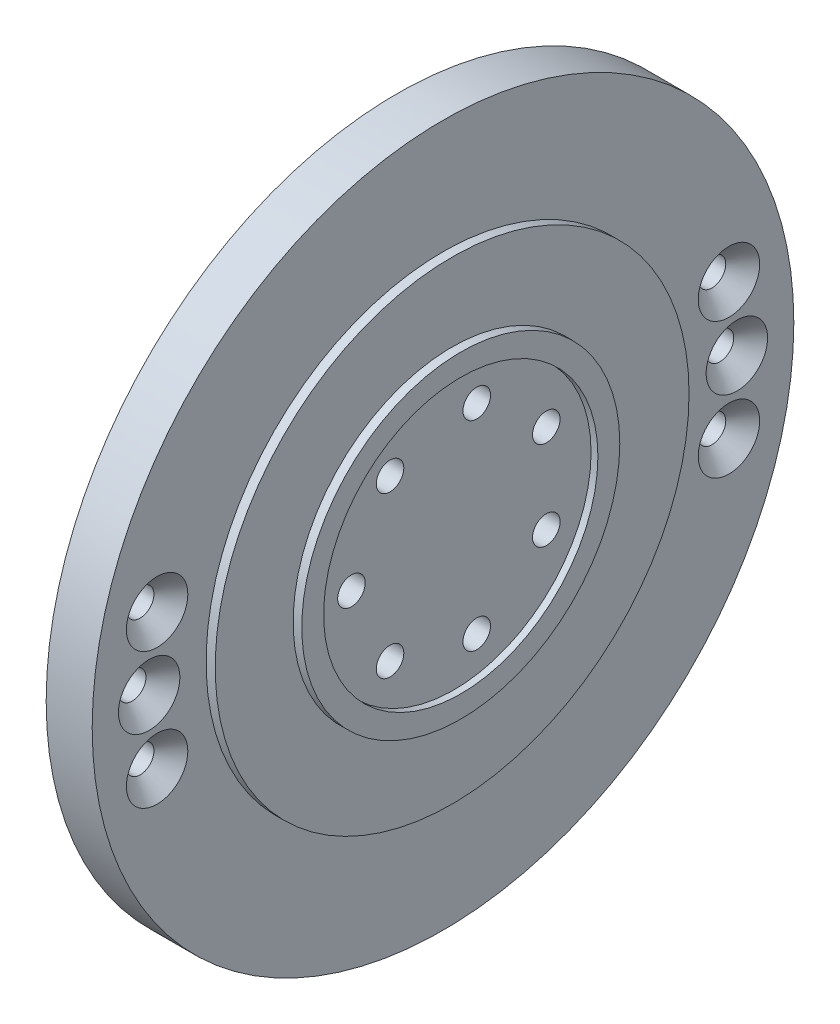
ISO-10303-21;
HEADER;
FILE_DESCRIPTION(('STEP AP214'),'2;1');
FILE_NAME('part.step','',(''),(''),'','','');
FILE_SCHEMA(('AUTOMOTIVE_DESIGN { 1 0 10303 214 1 1 1 1 }'));
ENDSEC;
DATA;
#1=APPLICATION_CONTEXT('core data for automotive mechanical design processes');
#2=APPLICATION_PROTOCOL_DEFINITION('international standard','automotive_design',2000,#1);
#3=PRODUCT_CONTEXT('',#1,'mechanical');
#4=PRODUCT('Part','Part','',(#3));
#5=PRODUCT_RELATED_PRODUCT_CATEGORY('part','',(#4));
#6=PRODUCT_DEFINITION_FORMATION('','',#4);
#7=PRODUCT_DEFINITION_CONTEXT('part definition',#1,'design');
#8=PRODUCT_DEFINITION('design','',#6,#7);
#9=PRODUCT_DEFINITION_SHAPE('','',#8);
#10=(LENGTH_UNIT() NAMED_UNIT(*) SI_UNIT(.MILLI.,.METRE.));
#11=(NAMED_UNIT(*) PLANE_ANGLE_UNIT() SI_UNIT($,.RADIAN.));
#12=(NAMED_UNIT(*) SI_UNIT($,.STERADIAN.) SOLID_ANGLE_UNIT());
#13=UNCERTAINTY_MEASURE_WITH_UNIT(LENGTH_MEASURE(1.E-05),#10,'distance_accuracy_value','');
#14=(GEOMETRIC_REPRESENTATION_CONTEXT(3) GLOBAL_UNCERTAINTY_ASSIGNED_CONTEXT((#13)) GLOBAL_UNIT_ASSIGNED_CONTEXT((#10,
#11,#12)) REPRESENTATION_CONTEXT('',''));
#15=CARTESIAN_POINT('',(0.,0.,0.));
#16=DIRECTION('',(0.,0.,1.));
#17=DIRECTION('',(1.,0.,0.));
#18=AXIS2_PLACEMENT_3D('',#15,#16,#17);
#19=CARTESIAN_POINT('',(-3.81,7.44912436188231,31.3779069767442));
#20=DIRECTION('',(1.,0.,0.));
#21=DIRECTION('',(0.,0.,-1.));
#22=AXIS2_PLACEMENT_3D('',#19,#20,#21);
#23=CONICAL_SURFACE('',#22,1.5125,0.785398163397448);
#24=CARTESIAN_POINT('',(-3.81,7.44912436188231,31.3779069767442));
#25=DIRECTION('',(1.,0.,0.));
#26=DIRECTION('',(0.,0.,-1.));
#27=AXIS2_PLACEMENT_3D('',#24,#25,#26);
#28=CIRCLE('',#27,1.5125);
#29=CARTESIAN_POINT('',(-3.81,7.44912436188231,29.8654069767442));
#30=VERTEX_POINT('',#29);
#31=EDGE_CURVE('E343',#30,#30,#28,.T.);
#32=ORIENTED_EDGE('',*,*,#31,.F.);
#33=EDGE_LOOP('',(#32));
#34=FACE_BOUND('',#33,.T.);
#35=CARTESIAN_POINT('',(-1.95,7.44912436188231,31.3779069767442));
#36=DIRECTION('',(-1.,0.,0.));
#37=DIRECTION('',(0.,0.,-1.));
#38=AXIS2_PLACEMENT_3D('',#35,#36,#37);
#39=CIRCLE('',#38,3.3725);
#40=CARTESIAN_POINT('',(-1.95,7.44912436188231,28.0054069767442));
#41=VERTEX_POINT('',#40);
#42=EDGE_CURVE('E276',#41,#41,#39,.T.);
#43=ORIENTED_EDGE('',*,*,#42,.F.);
#44=EDGE_LOOP('',(#43));
#45=FACE_BOUND('',#44,.T.);
#46=ADVANCED_FACE('F16',(#34,#45),#23,.F.);
#47=CARTESIAN_POINT('',(-3.81,0.,32.25));
#48=DIRECTION('',(1.,0.,0.));
#49=DIRECTION('',(0.,0.,-1.));
#50=AXIS2_PLACEMENT_3D('',#47,#48,#49);
#51=CONICAL_SURFACE('',#50,1.5125,0.785398163397448);
#52=CARTESIAN_POINT('',(-3.81,0.,32.25));
#53=DIRECTION('',(1.,0.,0.));
#54=DIRECTION('',(0.,0.,-1.));
#55=AXIS2_PLACEMENT_3D('',#52,#53,#54);
#56=CIRCLE('',#55,1.5125);
#57=CARTESIAN_POINT('',(-3.81,0.,30.7375));
#58=VERTEX_POINT('',#57);
#59=EDGE_CURVE('E256',#58,#58,#56,.T.);
#60=ORIENTED_EDGE('',*,*,#59,.F.);
#61=EDGE_LOOP('',(#60));
#62=FACE_BOUND('',#61,.T.);
#63=CARTESIAN_POINT('',(-1.95,0.,32.25));
#64=DIRECTION('',(-1.,0.,0.));
#65=DIRECTION('',(0.,0.,-1.));
#66=AXIS2_PLACEMENT_3D('',#63,#64,#65);
#67=CIRCLE('',#66,3.3725);
#68=CARTESIAN_POINT('',(-1.95,0.,28.8775));
#69=VERTEX_POINT('',#68);
#70=EDGE_CURVE('E272',#69,#69,#67,.T.);
#71=ORIENTED_EDGE('',*,*,#70,.F.);
#72=EDGE_LOOP('',(#71));
#73=FACE_BOUND('',#72,.T.);
#74=ADVANCED_FACE('F402',(#62,#73),#51,.F.);
#75=CARTESIAN_POINT('',(-3.81,7.44912436188231,-31.3779069767442));
#76=DIRECTION('',(1.,0.,0.));
#77=DIRECTION('',(0.,0.,-1.));
#78=AXIS2_PLACEMENT_3D('',#75,#76,#77);
#79=CONICAL_SURFACE('',#78,1.5125,0.785398163397448);
#80=CARTESIAN_POINT('',(-3.81,7.44912436188231,-31.3779069767442));
#81=DIRECTION('',(1.,0.,0.));
#82=DIRECTION('',(0.,0.,-1.));
#83=AXIS2_PLACEMENT_3D('',#80,#81,#82);
#84=CIRCLE('',#83,1.5125);
#85=CARTESIAN_POINT('',(-3.81,7.44912436188231,-32.8904069767442));
#86=VERTEX_POINT('',#85);
#87=EDGE_CURVE('E335',#86,#86,#84,.T.);
#88=ORIENTED_EDGE('',*,*,#87,.F.);
#89=EDGE_LOOP('',(#88));
#90=FACE_BOUND('',#89,.T.);
#91=CARTESIAN_POINT('',(-1.95,7.44912436188231,-31.3779069767442));
#92=DIRECTION('',(-1.,0.,0.));
#93=DIRECTION('',(0.,0.,-1.));
#94=AXIS2_PLACEMENT_3D('',#91,#92,#93);
#95=CIRCLE('',#94,3.3725);
#96=CARTESIAN_POINT('',(-1.95,7.44912436188231,-34.7504069767442));
#97=VERTEX_POINT('',#96);
#98=EDGE_CURVE('E275',#97,#97,#95,.T.);
#99=ORIENTED_EDGE('',*,*,#98,.F.);
#100=EDGE_LOOP('',(#99));
#101=FACE_BOUND('',#100,.T.);
#102=ADVANCED_FACE('F407',(#90,#101),#79,.F.);
#103=CARTESIAN_POINT('',(-3.81,-7.44912436188231,-31.3779069767442));
#104=DIRECTION('',(1.,0.,0.));
#105=DIRECTION('',(0.,0.,-1.));
#106=AXIS2_PLACEMENT_3D('',#103,#104,#105);
#107=CONICAL_SURFACE('',#106,1.5125,0.785398163397448);
#108=CARTESIAN_POINT('',(-3.81,-7.44912436188231,-31.3779069767442));
#109=DIRECTION('',(1.,0.,0.));
#110=DIRECTION('',(0.,0.,-1.));
#111=AXIS2_PLACEMENT_3D('',#108,#109,#110);
#112=CIRCLE('',#111,1.5125);
#113=CARTESIAN_POINT('',(-3.81,-7.44912436188231,-32.8904069767442));
#114=VERTEX_POINT('',#113);
#115=EDGE_CURVE('E135',#114,#114,#112,.T.);
#116=ORIENTED_EDGE('',*,*,#115,.F.);
#117=EDGE_LOOP('',(#116));
#118=FACE_BOUND('',#117,.T.);
#119=CARTESIAN_POINT('',(-1.95,-7.44912436188231,-31.3779069767442));
#120=DIRECTION('',(-1.,0.,0.));
#121=DIRECTION('',(0.,0.,-1.));
#122=AXIS2_PLACEMENT_3D('',#119,#120,#121);
#123=CIRCLE('',#122,3.3725);
#124=CARTESIAN_POINT('',(-1.95,-7.44912436188231,-34.7504069767442));
#125=VERTEX_POINT('',#124);
#126=EDGE_CURVE('E247',#125,#125,#123,.T.);
#127=ORIENTED_EDGE('',*,*,#126,.F.);
#128=EDGE_LOOP('',(#127));
#129=FACE_BOUND('',#128,.T.);
#130=ADVANCED_FACE('F429',(#118,#129),#107,.F.);
#131=CARTESIAN_POINT('',(-3.81,0.,-32.25));
#132=DIRECTION('',(1.,0.,0.));
#133=DIRECTION('',(0.,0.,-1.));
#134=AXIS2_PLACEMENT_3D('',#131,#132,#133);
#135=CONICAL_SURFACE('',#134,1.5125,0.785398163397448);
#136=CARTESIAN_POINT('',(-3.81,0.,-32.25));
#137=DIRECTION('',(1.,0.,0.));
#138=DIRECTION('',(0.,0.,-1.));
#139=AXIS2_PLACEMENT_3D('',#136,#137,#138);
#140=CIRCLE('',#139,1.5125);
#141=CARTESIAN_POINT('',(-3.81,0.,-33.7625));
#142=VERTEX_POINT('',#141);
#143=EDGE_CURVE('E294',#142,#142,#140,.T.);
#144=ORIENTED_EDGE('',*,*,#143,.F.);
#145=EDGE_LOOP('',(#144));
#146=FACE_BOUND('',#145,.T.);
#147=CARTESIAN_POINT('',(-1.95,0.,-32.25));
#148=DIRECTION('',(-1.,0.,0.));
#149=DIRECTION('',(0.,0.,-1.));
#150=AXIS2_PLACEMENT_3D('',#147,#148,#149);
#151=CIRCLE('',#150,3.3725);
#152=CARTESIAN_POINT('',(-1.95,0.,-35.6225));
#153=VERTEX_POINT('',#152);
#154=EDGE_CURVE('E27',#153,#153,#151,.T.);
#155=ORIENTED_EDGE('',*,*,#154,.F.);
#156=EDGE_LOOP('',(#155));
#157=FACE_BOUND('',#156,.T.);
#158=ADVANCED_FACE('F432',(#146,#157),#135,.F.);
#159=CARTESIAN_POINT('',(-3.81,-7.44912436188231,31.3779069767442));
#160=DIRECTION('',(1.,0.,0.));
#161=DIRECTION('',(0.,0.,-1.));
#162=AXIS2_PLACEMENT_3D('',#159,#160,#161);
#163=CONICAL_SURFACE('',#162,1.5125,0.785398163397448);
#164=CARTESIAN_POINT('',(-3.81,-7.44912436188231,31.3779069767442));
#165=DIRECTION('',(1.,0.,0.));
#166=DIRECTION('',(0.,0.,-1.));
#167=AXIS2_PLACEMENT_3D('',#164,#165,#166);
#168=CIRCLE('',#167,1.5125);
#169=CARTESIAN_POINT('',(-3.81,-7.44912436188231,29.8654069767442));
#170=VERTEX_POINT('',#169);
#171=EDGE_CURVE('E325',#170,#170,#168,.T.);
#172=ORIENTED_EDGE('',*,*,#171,.F.);
#173=EDGE_LOOP('',(#172));
#174=FACE_BOUND('',#173,.T.);
#175=CARTESIAN_POINT('',(-1.95,-7.44912436188231,31.3779069767442));
#176=DIRECTION('',(-1.,0.,0.));
#177=DIRECTION('',(0.,0.,-1.));
#178=AXIS2_PLACEMENT_3D('',#175,#176,#177);
#179=CIRCLE('',#178,3.3725);
#180=CARTESIAN_POINT('',(-1.95,-7.44912436188231,28.0054069767442));
#181=VERTEX_POINT('',#180);
#182=EDGE_CURVE('E11',#181,#181,#179,.T.);
#183=ORIENTED_EDGE('',*,*,#182,.F.);
#184=EDGE_LOOP('',(#183));
#185=FACE_BOUND('',#184,.T.);
#186=ADVANCED_FACE('F423',(#174,#185),#163,.F.);
#187=CARTESIAN_POINT('',(-5.14,0.,11.25));
#188=DIRECTION('',(-1.,0.,0.));
#189=DIRECTION('',(0.,0.,1.));
#190=AXIS2_PLACEMENT_3D('',#187,#188,#189);
#191=CONICAL_SURFACE('',#190,1.5125,0.785398163397448);
#192=CARTESIAN_POINT('',(-7.,0.,11.25));
#193=DIRECTION('',(-1.,0.,0.));
#194=DIRECTION('',(0.,0.,-1.));
#195=AXIS2_PLACEMENT_3D('',#192,#193,#194);
#196=CIRCLE('',#195,3.3725);
#197=CARTESIAN_POINT('',(-7.,0.,7.8775));
#198=VERTEX_POINT('',#197);
#199=EDGE_CURVE('E361',#198,#198,#196,.T.);
#200=ORIENTED_EDGE('',*,*,#199,.T.);
#201=EDGE_LOOP('',(#200));
#202=FACE_BOUND('',#201,.T.);
#203=CARTESIAN_POINT('',(-5.14,0.,11.25));
#204=DIRECTION('',(-1.,0.,0.));
#205=DIRECTION('',(0.,0.,1.));
#206=AXIS2_PLACEMENT_3D('',#203,#204,#205);
#207=CIRCLE('',#206,1.5125);
#208=CARTESIAN_POINT('',(-5.14,0.,12.7625));
#209=VERTEX_POINT('',#208);
#210=EDGE_CURVE('E270',#209,#209,#207,.T.);
#211=ORIENTED_EDGE('',*,*,#210,.F.);
#212=EDGE_LOOP('',(#211));
#213=FACE_BOUND('',#212,.T.);
#214=ADVANCED_FACE('F419',(#202,#213),#191,.F.);
#215=CARTESIAN_POINT('',(-5.14,8.79560417776534,7.01426027091075));
#216=DIRECTION('',(-1.,0.,0.));
#217=DIRECTION('',(0.,0.,1.));
#218=AXIS2_PLACEMENT_3D('',#215,#216,#217);
#219=CONICAL_SURFACE('',#218,1.5125,0.785398163397448);
#220=CARTESIAN_POINT('',(-7.,8.79560417776534,7.01426027091075));
#221=DIRECTION('',(-1.,0.,0.));
#222=DIRECTION('',(0.,0.,-1.));
#223=AXIS2_PLACEMENT_3D('',#220,#221,#222);
#224=CIRCLE('',#223,3.3725);
#225=CARTESIAN_POINT('',(-7.,8.79560417776534,3.64176027091075));
#226=VERTEX_POINT('',#225);
#227=EDGE_CURVE('E266',#226,#226,#224,.T.);
#228=ORIENTED_EDGE('',*,*,#227,.T.);
#229=EDGE_LOOP('',(#228));
#230=FACE_BOUND('',#229,.T.);
#231=CARTESIAN_POINT('',(-5.14,8.79560417776534,7.01426027091075));
#232=DIRECTION('',(-1.,0.,0.));
#233=DIRECTION('',(0.,0.,1.));
#234=AXIS2_PLACEMENT_3D('',#231,#232,#233);
#235=CIRCLE('',#234,1.5125);
#236=CARTESIAN_POINT('',(-5.14,8.79560417776534,8.52676027091075));
#237=VERTEX_POINT('',#236);
#238=EDGE_CURVE('E286',#237,#237,#235,.T.);
#239=ORIENTED_EDGE('',*,*,#238,.F.);
#240=EDGE_LOOP('',(#239));
#241=FACE_BOUND('',#240,.T.);
#242=ADVANCED_FACE('F422',(#230,#241),#219,.F.);
#243=CARTESIAN_POINT('',(-5.14,-8.79560417776534,7.01426027091075));
#244=DIRECTION('',(-1.,0.,0.));
#245=DIRECTION('',(0.,0.,1.));
#246=AXIS2_PLACEMENT_3D('',#243,#244,#245);
#247=CONICAL_SURFACE('',#246,1.5125,0.785398163397448);
#248=CARTESIAN_POINT('',(-7.,-8.79560417776534,7.01426027091075));
#249=DIRECTION('',(-1.,0.,0.));
#250=DIRECTION('',(0.,0.,-1.));
#251=AXIS2_PLACEMENT_3D('',#248,#249,#250);
#252=CIRCLE('',#251,3.3725);
#253=CARTESIAN_POINT('',(-7.,-8.79560417776534,3.64176027091075));
#254=VERTEX_POINT('',#253);
#255=EDGE_CURVE('E262',#254,#254,#252,.T.);
#256=ORIENTED_EDGE('',*,*,#255,.T.);
#257=EDGE_LOOP('',(#256));
#258=FACE_BOUND('',#257,.T.);
#259=CARTESIAN_POINT('',(-5.14,-8.79560417776534,7.01426027091075));
#260=DIRECTION('',(-1.,0.,0.));
#261=DIRECTION('',(0.,0.,1.));
#262=AXIS2_PLACEMENT_3D('',#259,#260,#261);
#263=CIRCLE('',#262,1.5125);
#264=CARTESIAN_POINT('',(-5.14,-8.79560417776534,8.52676027091075));
#265=VERTEX_POINT('',#264);
#266=EDGE_CURVE('E271',#265,#265,#263,.T.);
#267=ORIENTED_EDGE('',*,*,#266,.F.);
#268=EDGE_LOOP('',(#267));
#269=FACE_BOUND('',#268,.T.);
#270=ADVANCED_FACE('F427',(#258,#269),#247,.F.);
#271=CARTESIAN_POINT('',(-5.14,-10.9679390120455,-2.50336050700853));
#272=DIRECTION('',(-1.,0.,0.));
#273=DIRECTION('',(0.,0.,1.));
#274=AXIS2_PLACEMENT_3D('',#271,#272,#273);
#275=CONICAL_SURFACE('',#274,1.5125,0.785398163397448);
#276=CARTESIAN_POINT('',(-7.,-10.9679390120455,-2.50336050700853));
#277=DIRECTION('',(-1.,0.,0.));
#278=DIRECTION('',(0.,0.,-1.));
#279=AXIS2_PLACEMENT_3D('',#276,#277,#278);
#280=CIRCLE('',#279,3.3725);
#281=CARTESIAN_POINT('',(-7.,-10.9679390120455,-5.87586050700853));
#282=VERTEX_POINT('',#281);
#283=EDGE_CURVE('E252',#282,#282,#280,.T.);
#284=ORIENTED_EDGE('',*,*,#283,.T.);
#285=EDGE_LOOP('',(#284));
#286=FACE_BOUND('',#285,.T.);
#287=CARTESIAN_POINT('',(-5.14,-10.9679390120455,-2.50336050700853));
#288=DIRECTION('',(-1.,0.,0.));
#289=DIRECTION('',(0.,0.,1.));
#290=AXIS2_PLACEMENT_3D('',#287,#288,#289);
#291=CIRCLE('',#290,1.5125);
#292=CARTESIAN_POINT('',(-5.14,-10.9679390120455,-0.990860507008535));
#293=VERTEX_POINT('',#292);
#294=EDGE_CURVE('E304',#293,#293,#291,.T.);
#295=ORIENTED_EDGE('',*,*,#294,.F.);
#296=EDGE_LOOP('',(#295));
#297=FACE_BOUND('',#296,.T.);
#298=ADVANCED_FACE('F484',(#286,#297),#275,.F.);
#299=CARTESIAN_POINT('',(-5.14,4.88119206507253,-10.1358997639022));
#300=DIRECTION('',(-1.,0.,0.));
#301=DIRECTION('',(0.,0.,1.));
#302=AXIS2_PLACEMENT_3D('',#299,#300,#301);
#303=CONICAL_SURFACE('',#302,1.5125,0.785398163397448);
#304=CARTESIAN_POINT('',(-7.,4.88119206507253,-10.1358997639022));
#305=DIRECTION('',(-1.,0.,0.));
#306=DIRECTION('',(0.,0.,-1.));
#307=AXIS2_PLACEMENT_3D('',#304,#305,#306);
#308=CIRCLE('',#307,3.3725);
#309=CARTESIAN_POINT('',(-7.,4.88119206507253,-13.5083997639022));
#310=VERTEX_POINT('',#309);
#311=EDGE_CURVE('E248',#310,#310,#308,.T.);
#312=ORIENTED_EDGE('',*,*,#311,.T.);
#313=EDGE_LOOP('',(#312));
#314=FACE_BOUND('',#313,.T.);
#315=CARTESIAN_POINT('',(-5.14,4.88119206507253,-10.1358997639022));
#316=DIRECTION('',(-1.,0.,0.));
#317=DIRECTION('',(0.,0.,1.));
#318=AXIS2_PLACEMENT_3D('',#315,#316,#317);
#319=CIRCLE('',#318,1.5125);
#320=CARTESIAN_POINT('',(-5.14,4.88119206507253,-8.6233997639022));
#321=VERTEX_POINT('',#320);
#322=EDGE_CURVE('E228',#321,#321,#319,.T.);
#323=ORIENTED_EDGE('',*,*,#322,.F.);
#324=EDGE_LOOP('',(#323));
#325=FACE_BOUND('',#324,.T.);
#326=ADVANCED_FACE('F482',(#314,#325),#303,.F.);
#327=CARTESIAN_POINT('',(-5.14,10.9679390120455,-2.50336050700854));
#328=DIRECTION('',(-1.,0.,0.));
#329=DIRECTION('',(0.,0.,1.));
#330=AXIS2_PLACEMENT_3D('',#327,#328,#329);
#331=CONICAL_SURFACE('',#330,1.5125,0.785398163397448);
#332=CARTESIAN_POINT('',(-7.,10.9679390120455,-2.50336050700854));
#333=DIRECTION('',(-1.,0.,0.));
#334=DIRECTION('',(0.,0.,-1.));
#335=AXIS2_PLACEMENT_3D('',#332,#333,#334);
#336=CIRCLE('',#335,3.3725);
#337=CARTESIAN_POINT('',(-7.,10.9679390120455,-5.87586050700854));
#338=VERTEX_POINT('',#337);
#339=EDGE_CURVE('E251',#338,#338,#336,.T.);
#340=ORIENTED_EDGE('',*,*,#339,.T.);
#341=EDGE_LOOP('',(#340));
#342=FACE_BOUND('',#341,.T.);
#343=CARTESIAN_POINT('',(-5.14,10.9679390120455,-2.50336050700854));
#344=DIRECTION('',(-1.,0.,0.));
#345=DIRECTION('',(0.,0.,1.));
#346=AXIS2_PLACEMENT_3D('',#343,#344,#345);
#347=CIRCLE('',#346,1.5125);
#348=CARTESIAN_POINT('',(-5.14,10.9679390120455,-0.99086050700854));
#349=VERTEX_POINT('',#348);
#350=EDGE_CURVE('E229',#349,#349,#347,.T.);
#351=ORIENTED_EDGE('',*,*,#350,.F.);
#352=EDGE_LOOP('',(#351));
#353=FACE_BOUND('',#352,.T.);
#354=ADVANCED_FACE('F478',(#342,#353),#331,.F.);
#355=CARTESIAN_POINT('',(-5.14,-4.88119206507253,-10.1358997639022));
#356=DIRECTION('',(-1.,0.,0.));
#357=DIRECTION('',(0.,0.,1.));
#358=AXIS2_PLACEMENT_3D('',#355,#356,#357);
#359=CONICAL_SURFACE('',#358,1.5125,0.785398163397448);
#360=CARTESIAN_POINT('',(-7.,-4.88119206507253,-10.1358997639022));
#361=DIRECTION('',(-1.,0.,0.));
#362=DIRECTION('',(0.,0.,-1.));
#363=AXIS2_PLACEMENT_3D('',#360,#361,#362);
#364=CIRCLE('',#363,3.3725);
#365=CARTESIAN_POINT('',(-7.,-4.88119206507253,-13.5083997639022));
#366=VERTEX_POINT('',#365);
#367=EDGE_CURVE('E279',#366,#366,#364,.T.);
#368=ORIENTED_EDGE('',*,*,#367,.T.);
#369=EDGE_LOOP('',(#368));
#370=FACE_BOUND('',#369,.T.);
#371=CARTESIAN_POINT('',(-5.14,-4.88119206507253,-10.1358997639022));
#372=DIRECTION('',(-1.,0.,0.));
#373=DIRECTION('',(0.,0.,1.));
#374=AXIS2_PLACEMENT_3D('',#371,#372,#373);
#375=CIRCLE('',#374,1.5125);
#376=CARTESIAN_POINT('',(-5.14,-4.88119206507253,-8.6233997639022));
#377=VERTEX_POINT('',#376);
#378=EDGE_CURVE('E296',#377,#377,#375,.T.);
#379=ORIENTED_EDGE('',*,*,#378,.F.);
#380=EDGE_LOOP('',(#379));
#381=FACE_BOUND('',#380,.T.);
#382=ADVANCED_FACE('F417',(#370,#381),#359,.F.);
#383=CARTESIAN_POINT('',(-1.95,0.,0.));
#384=DIRECTION('',(1.,0.,0.));
#385=DIRECTION('',(0.,1.,0.));
#386=AXIS2_PLACEMENT_3D('',#383,#384,#385);
#387=PLANE('',#386);
#388=CARTESIAN_POINT('',(-1.95,0.,0.));
#389=DIRECTION('',(1.,0.,0.));
#390=DIRECTION('',(0.,0.,-1.));
#391=AXIS2_PLACEMENT_3D('',#388,#389,#390);
#392=CIRCLE('',#391,38.5);
#393=CARTESIAN_POINT('',(-1.95,0.,-38.5));
#394=VERTEX_POINT('',#393);
#395=EDGE_CURVE('E257',#394,#394,#392,.T.);
#396=ORIENTED_EDGE('',*,*,#395,.T.);
#397=EDGE_LOOP('',(#396));
#398=FACE_BOUND('',#397,.T.);
#399=CARTESIAN_POINT('',(-1.95,0.,0.));
#400=DIRECTION('',(1.,0.,0.));
#401=DIRECTION('',(0.,0.,-1.));
#402=AXIS2_PLACEMENT_3D('',#399,#400,#401);
#403=CIRCLE('',#402,26.);
#404=CARTESIAN_POINT('',(-1.95,0.,-26.));
#405=VERTEX_POINT('',#404);
#406=EDGE_CURVE('E243',#405,#405,#403,.T.);
#407=ORIENTED_EDGE('',*,*,#406,.F.);
#408=EDGE_LOOP('',(#407));
#409=FACE_BOUND('',#408,.T.);
#410=ORIENTED_EDGE('',*,*,#182,.T.);
#411=EDGE_LOOP('',(#410));
#412=FACE_BOUND('',#411,.T.);
#413=ORIENTED_EDGE('',*,*,#154,.T.);
#414=EDGE_LOOP('',(#413));
#415=FACE_BOUND('',#414,.T.);
#416=ORIENTED_EDGE('',*,*,#126,.T.);
#417=EDGE_LOOP('',(#416));
#418=FACE_BOUND('',#417,.T.);
#419=ORIENTED_EDGE('',*,*,#98,.T.);
#420=EDGE_LOOP('',(#419));
#421=FACE_BOUND('',#420,.T.);
#422=ORIENTED_EDGE('',*,*,#70,.T.);
#423=EDGE_LOOP('',(#422));
#424=FACE_BOUND('',#423,.T.);
#425=ORIENTED_EDGE('',*,*,#42,.T.);
#426=EDGE_LOOP('',(#425));
#427=FACE_BOUND('',#426,.T.);
#428=ADVANCED_FACE('F413',(#398,#409,#412,#415,#418,#421,#424,#427),#387,.T.);
#429=CARTESIAN_POINT('',(-1.95,0.,0.));
#430=DIRECTION('',(1.,0.,0.));
#431=DIRECTION('',(0.,0.,-1.));
#432=AXIS2_PLACEMENT_3D('',#429,#430,#431);
#433=CYLINDRICAL_SURFACE('',#432,26.);
#434=CARTESIAN_POINT('',(-0.95,0.,0.));
#435=DIRECTION('',(1.,0.,0.));
#436=DIRECTION('',(0.,0.,-1.));
#437=AXIS2_PLACEMENT_3D('',#434,#435,#436);
#438=CIRCLE('',#437,26.);
#439=CARTESIAN_POINT('',(-0.95,0.,-26.));
#440=VERTEX_POINT('',#439);
#441=EDGE_CURVE('E282',#440,#440,#438,.T.);
#442=ORIENTED_EDGE('',*,*,#441,.F.);
#443=EDGE_LOOP('',(#442));
#444=FACE_BOUND('',#443,.T.);
#445=ORIENTED_EDGE('',*,*,#406,.T.);
#446=EDGE_LOOP('',(#445));
#447=FACE_BOUND('',#446,.T.);
#448=ADVANCED_FACE('F416',(#444,#447),#433,.T.);
#449=CARTESIAN_POINT('',(-0.75,0.,0.));
#450=DIRECTION('',(1.,0.,0.));
#451=DIRECTION('',(0.,1.,0.));
#452=AXIS2_PLACEMENT_3D('',#449,#450,#451);
#453=PLANE('',#452);
#454=CARTESIAN_POINT('',(-0.75,0.,0.));
#455=DIRECTION('',(1.,0.,0.));
#456=DIRECTION('',(0.,0.,-1.));
#457=AXIS2_PLACEMENT_3D('',#454,#455,#456);
#458=CIRCLE('',#457,15.05);
#459=CARTESIAN_POINT('',(-0.75,0.,-15.05));
#460=VERTEX_POINT('',#459);
#461=EDGE_CURVE('E320',#460,#460,#458,.T.);
#462=ORIENTED_EDGE('',*,*,#461,.T.);
#463=EDGE_LOOP('',(#462));
#464=FACE_BOUND('',#463,.T.);
#465=CARTESIAN_POINT('',(-0.75,8.79560417776534,7.01426027091075));
#466=DIRECTION('',(1.,0.,0.));
#467=DIRECTION('',(0.,0.,-1.));
#468=AXIS2_PLACEMENT_3D('',#465,#466,#467);
#469=CIRCLE('',#468,1.5125);
#470=CARTESIAN_POINT('',(-0.75,8.79560417776534,5.50176027091075));
#471=VERTEX_POINT('',#470);
#472=EDGE_CURVE('E289',#471,#471,#469,.T.);
#473=ORIENTED_EDGE('',*,*,#472,.F.);
#474=EDGE_LOOP('',(#473));
#475=FACE_BOUND('',#474,.T.);
#476=CARTESIAN_POINT('',(-0.75,10.9679390120455,-2.50336050700854));
#477=DIRECTION('',(1.,0.,0.));
#478=DIRECTION('',(0.,0.,-1.));
#479=AXIS2_PLACEMENT_3D('',#476,#477,#478);
#480=CIRCLE('',#479,1.5125);
#481=CARTESIAN_POINT('',(-0.75,10.9679390120455,-4.01586050700854));
#482=VERTEX_POINT('',#481);
#483=EDGE_CURVE('E239',#482,#482,#480,.T.);
#484=ORIENTED_EDGE('',*,*,#483,.F.);
#485=EDGE_LOOP('',(#484));
#486=FACE_BOUND('',#485,.T.);
#487=CARTESIAN_POINT('',(-0.75,4.88119206507253,-10.1358997639022));
#488=DIRECTION('',(1.,0.,0.));
#489=DIRECTION('',(0.,0.,-1.));
#490=AXIS2_PLACEMENT_3D('',#487,#488,#489);
#491=CIRCLE('',#490,1.5125);
#492=CARTESIAN_POINT('',(-0.75,4.88119206507253,-11.6483997639022));
#493=VERTEX_POINT('',#492);
#494=EDGE_CURVE('E224',#493,#493,#491,.T.);
#495=ORIENTED_EDGE('',*,*,#494,.F.);
#496=EDGE_LOOP('',(#495));
#497=FACE_BOUND('',#496,.T.);
#498=CARTESIAN_POINT('',(-0.75,-4.88119206507253,-10.1358997639022));
#499=DIRECTION('',(1.,0.,0.));
#500=DIRECTION('',(0.,0.,-1.));
#501=AXIS2_PLACEMENT_3D('',#498,#499,#500);
#502=CIRCLE('',#501,1.5125);
#503=CARTESIAN_POINT('',(-0.75,-4.88119206507253,-11.6483997639022));
#504=VERTEX_POINT('',#503);
#505=EDGE_CURVE('E236',#504,#504,#502,.T.);
#506=ORIENTED_EDGE('',*,*,#505,.F.);
#507=EDGE_LOOP('',(#506));
#508=FACE_BOUND('',#507,.T.);
#509=CARTESIAN_POINT('',(-0.75,-10.9679390120455,-2.50336050700853));
#510=DIRECTION('',(1.,0.,0.));
#511=DIRECTION('',(0.,0.,-1.));
#512=AXIS2_PLACEMENT_3D('',#509,#510,#511);
#513=CIRCLE('',#512,1.5125);
#514=CARTESIAN_POINT('',(-0.75,-10.9679390120455,-4.01586050700853));
#515=VERTEX_POINT('',#514);
#516=EDGE_CURVE('E312',#515,#515,#513,.T.);
#517=ORIENTED_EDGE('',*,*,#516,.F.);
#518=EDGE_LOOP('',(#517));
#519=FACE_BOUND('',#518,.T.);
#520=CARTESIAN_POINT('',(-0.75,-8.79560417776534,7.01426027091075));
#521=DIRECTION('',(1.,0.,0.));
#522=DIRECTION('',(0.,0.,-1.));
#523=AXIS2_PLACEMENT_3D('',#520,#521,#522);
#524=CIRCLE('',#523,1.5125);
#525=CARTESIAN_POINT('',(-0.75,-8.79560417776534,5.50176027091075));
#526=VERTEX_POINT('',#525);
#527=EDGE_CURVE('E299',#526,#526,#524,.T.);
#528=ORIENTED_EDGE('',*,*,#527,.F.);
#529=EDGE_LOOP('',(#528));
#530=FACE_BOUND('',#529,.T.);
#531=CARTESIAN_POINT('',(-0.75,0.,11.25));
#532=DIRECTION('',(1.,0.,0.));
#533=DIRECTION('',(0.,0.,-1.));
#534=AXIS2_PLACEMENT_3D('',#531,#532,#533);
#535=CIRCLE('',#534,1.5125);
#536=CARTESIAN_POINT('',(-0.75,0.,9.7375));
#537=VERTEX_POINT('',#536);
#538=EDGE_CURVE('E267',#537,#537,#535,.T.);
#539=ORIENTED_EDGE('',*,*,#538,.F.);
#540=EDGE_LOOP('',(#539));
#541=FACE_BOUND('',#540,.T.);
#542=ADVANCED_FACE('F471',(#464,#475,#486,#497,#508,#519,#530,#541),#453,.T.);
#543=CARTESIAN_POINT('',(-0.75,0.,0.));
#544=DIRECTION('',(1.,0.,0.));
#545=DIRECTION('',(0.,0.,-1.));
#546=AXIS2_PLACEMENT_3D('',#543,#544,#545);
#547=CYLINDRICAL_SURFACE('',#546,15.05);
#548=CARTESIAN_POINT('',(0.,0.,0.));
#549=DIRECTION('',(1.,0.,0.));
#550=DIRECTION('',(0.,0.,-1.));
#551=AXIS2_PLACEMENT_3D('',#548,#549,#550);
#552=CIRCLE('',#551,15.05);
#553=CARTESIAN_POINT('',(0.,0.,-15.05));
#554=VERTEX_POINT('',#553);
#555=EDGE_CURVE('E280',#554,#554,#552,.T.);
#556=ORIENTED_EDGE('',*,*,#555,.T.);
#557=EDGE_LOOP('',(#556));
#558=FACE_BOUND('',#557,.T.);
#559=ORIENTED_EDGE('',*,*,#461,.F.);
#560=EDGE_LOOP('',(#559));
#561=FACE_BOUND('',#560,.T.);
#562=ADVANCED_FACE('F474',(#558,#561),#547,.F.);
#563=CARTESIAN_POINT('',(-0.95,0.,0.));
#564=DIRECTION('',(1.,0.,0.));
#565=DIRECTION('',(0.,0.,-1.));
#566=AXIS2_PLACEMENT_3D('',#563,#564,#565);
#567=CYLINDRICAL_SURFACE('',#566,17.45);
#568=CARTESIAN_POINT('',(0.,0.,0.));
#569=DIRECTION('',(1.,0.,0.));
#570=DIRECTION('',(0.,0.,-1.));
#571=AXIS2_PLACEMENT_3D('',#568,#569,#570);
#572=CIRCLE('',#571,17.45);
#573=CARTESIAN_POINT('',(0.,0.,-17.45));
#574=VERTEX_POINT('',#573);
#575=EDGE_CURVE('E20',#574,#574,#572,.T.);
#576=ORIENTED_EDGE('',*,*,#575,.F.);
#577=EDGE_LOOP('',(#576));
#578=FACE_BOUND('',#577,.T.);
#579=CARTESIAN_POINT('',(-0.95,0.,0.));
#580=DIRECTION('',(1.,0.,0.));
#581=DIRECTION('',(0.,0.,-1.));
#582=AXIS2_PLACEMENT_3D('',#579,#580,#581);
#583=CIRCLE('',#582,17.45);
#584=CARTESIAN_POINT('',(-0.95,0.,-17.45));
#585=VERTEX_POINT('',#584);
#586=EDGE_CURVE('E260',#585,#585,#583,.T.);
#587=ORIENTED_EDGE('',*,*,#586,.T.);
#588=EDGE_LOOP('',(#587));
#589=FACE_BOUND('',#588,.T.);
#590=ADVANCED_FACE('F437',(#578,#589),#567,.T.);
#591=CARTESIAN_POINT('',(-7.,0.,0.));
#592=DIRECTION('',(1.,0.,0.));
#593=DIRECTION('',(0.,1.,0.));
#594=AXIS2_PLACEMENT_3D('',#591,#592,#593);
#595=PLANE('',#594);
#596=CARTESIAN_POINT('',(-7.,0.,0.));
#597=DIRECTION('',(1.,0.,0.));
#598=DIRECTION('',(0.,0.,-1.));
#599=AXIS2_PLACEMENT_3D('',#596,#597,#598);
#600=CIRCLE('',#599,38.5);
#601=CARTESIAN_POINT('',(-7.,0.,-38.5));
#602=VERTEX_POINT('',#601);
#603=EDGE_CURVE('E261',#602,#602,#600,.T.);
#604=ORIENTED_EDGE('',*,*,#603,.F.);
#605=EDGE_LOOP('',(#604));
#606=FACE_BOUND('',#605,.T.);
#607=CARTESIAN_POINT('',(-7.,0.,-32.25));
#608=DIRECTION('',(1.,0.,0.));
#609=DIRECTION('',(0.,0.,-1.));
#610=AXIS2_PLACEMENT_3D('',#607,#608,#609);
#611=CIRCLE('',#610,1.5125);
#612=CARTESIAN_POINT('',(-7.,0.,-33.7625));
#613=VERTEX_POINT('',#612);
#614=EDGE_CURVE('E367',#613,#613,#611,.T.);
#615=ORIENTED_EDGE('',*,*,#614,.T.);
#616=EDGE_LOOP('',(#615));
#617=FACE_BOUND('',#616,.T.);
#618=CARTESIAN_POINT('',(-7.,-7.44912436188231,-31.3779069767442));
#619=DIRECTION('',(1.,0.,0.));
#620=DIRECTION('',(0.,0.,-1.));
#621=AXIS2_PLACEMENT_3D('',#618,#619,#620);
#622=CIRCLE('',#621,1.5125);
#623=CARTESIAN_POINT('',(-7.,-7.44912436188231,-32.8904069767442));
#624=VERTEX_POINT('',#623);
#625=EDGE_CURVE('E126',#624,#624,#622,.T.);
#626=ORIENTED_EDGE('',*,*,#625,.T.);
#627=EDGE_LOOP('',(#626));
#628=FACE_BOUND('',#627,.T.);
#629=CARTESIAN_POINT('',(-7.,0.,32.25));
#630=DIRECTION('',(-1.,0.,0.));
#631=DIRECTION('',(0.,0.,-1.));
#632=AXIS2_PLACEMENT_3D('',#629,#630,#631);
#633=CIRCLE('',#632,1.5125);
#634=CARTESIAN_POINT('',(-7.,0.,30.7375));
#635=VERTEX_POINT('',#634);
#636=EDGE_CURVE('E253',#635,#635,#633,.T.);
#637=ORIENTED_EDGE('',*,*,#636,.F.);
#638=EDGE_LOOP('',(#637));
#639=FACE_BOUND('',#638,.T.);
#640=CARTESIAN_POINT('',(-7.,-7.44912436188231,31.3779069767442));
#641=DIRECTION('',(-1.,0.,0.));
#642=DIRECTION('',(0.,0.,-1.));
#643=AXIS2_PLACEMENT_3D('',#640,#641,#642);
#644=CIRCLE('',#643,1.5125);
#645=CARTESIAN_POINT('',(-7.,-7.44912436188231,29.8654069767442));
#646=VERTEX_POINT('',#645);
#647=EDGE_CURVE('E329',#646,#646,#644,.T.);
#648=ORIENTED_EDGE('',*,*,#647,.F.);
#649=EDGE_LOOP('',(#648));
#650=FACE_BOUND('',#649,.T.);
#651=CARTESIAN_POINT('',(-7.,7.44912436188231,31.3779069767442));
#652=DIRECTION('',(1.,0.,0.));
#653=DIRECTION('',(0.,0.,-1.));
#654=AXIS2_PLACEMENT_3D('',#651,#652,#653);
#655=CIRCLE('',#654,1.5125);
#656=CARTESIAN_POINT('',(-7.,7.44912436188231,29.8654069767442));
#657=VERTEX_POINT('',#656);
#658=EDGE_CURVE('E328',#657,#657,#655,.T.);
#659=ORIENTED_EDGE('',*,*,#658,.T.);
#660=EDGE_LOOP('',(#659));
#661=FACE_BOUND('',#660,.T.);
#662=CARTESIAN_POINT('',(-7.,7.44912436188231,-31.3779069767442));
#663=DIRECTION('',(-1.,0.,0.));
#664=DIRECTION('',(0.,0.,-1.));
#665=AXIS2_PLACEMENT_3D('',#662,#663,#664);
#666=CIRCLE('',#665,1.5125);
#667=CARTESIAN_POINT('',(-7.,7.44912436188231,-32.8904069767442));
#668=VERTEX_POINT('',#667);
#669=EDGE_CURVE('E336',#668,#668,#666,.T.);
#670=ORIENTED_EDGE('',*,*,#669,.F.);
#671=EDGE_LOOP('',(#670));
#672=FACE_BOUND('',#671,.T.);
#673=ORIENTED_EDGE('',*,*,#367,.F.);
#674=EDGE_LOOP('',(#673));
#675=FACE_BOUND('',#674,.T.);
#676=ORIENTED_EDGE('',*,*,#339,.F.);
#677=EDGE_LOOP('',(#676));
#678=FACE_BOUND('',#677,.T.);
#679=ORIENTED_EDGE('',*,*,#311,.F.);
#680=EDGE_LOOP('',(#679));
#681=FACE_BOUND('',#680,.T.);
#682=ORIENTED_EDGE('',*,*,#283,.F.);
#683=EDGE_LOOP('',(#682));
#684=FACE_BOUND('',#683,.T.);
#685=ORIENTED_EDGE('',*,*,#255,.F.);
#686=EDGE_LOOP('',(#685));
#687=FACE_BOUND('',#686,.T.);
#688=ORIENTED_EDGE('',*,*,#227,.F.);
#689=EDGE_LOOP('',(#688));
#690=FACE_BOUND('',#689,.T.);
#691=ORIENTED_EDGE('',*,*,#199,.F.);
#692=EDGE_LOOP('',(#691));
#693=FACE_BOUND('',#692,.T.);
#694=ADVANCED_FACE('F383',(#606,#617,#628,#639,#650,#661,#672,#675,#678,#681,#684,#687,#690,
#693),#595,.F.);
#695=CARTESIAN_POINT('',(0.,0.,0.));
#696=DIRECTION('',(1.,0.,0.));
#697=DIRECTION('',(0.,1.,0.));
#698=AXIS2_PLACEMENT_3D('',#695,#696,#697);
#699=PLANE('',#698);
#700=ORIENTED_EDGE('',*,*,#575,.T.);
#701=EDGE_LOOP('',(#700));
#702=FACE_BOUND('',#701,.T.);
#703=ORIENTED_EDGE('',*,*,#555,.F.);
#704=EDGE_LOOP('',(#703));
#705=FACE_BOUND('',#704,.T.);
#706=ADVANCED_FACE('F436',(#702,#705),#699,.T.);
#707=CARTESIAN_POINT('',(-0.95,0.,0.));
#708=DIRECTION('',(1.,0.,0.));
#709=DIRECTION('',(0.,1.,0.));
#710=AXIS2_PLACEMENT_3D('',#707,#708,#709);
#711=PLANE('',#710);
#712=ORIENTED_EDGE('',*,*,#441,.T.);
#713=EDGE_LOOP('',(#712));
#714=FACE_BOUND('',#713,.T.);
#715=ORIENTED_EDGE('',*,*,#586,.F.);
#716=EDGE_LOOP('',(#715));
#717=FACE_BOUND('',#716,.T.);
#718=ADVANCED_FACE('F441',(#714,#717),#711,.T.);
#719=CARTESIAN_POINT('',(-7.,0.,0.));
#720=DIRECTION('',(1.,0.,0.));
#721=DIRECTION('',(0.,0.,-1.));
#722=AXIS2_PLACEMENT_3D('',#719,#720,#721);
#723=CYLINDRICAL_SURFACE('',#722,38.5);
#724=ORIENTED_EDGE('',*,*,#395,.F.);
#725=EDGE_LOOP('',(#724));
#726=FACE_BOUND('',#725,.T.);
#727=ORIENTED_EDGE('',*,*,#603,.T.);
#728=EDGE_LOOP('',(#727));
#729=FACE_BOUND('',#728,.T.);
#730=ADVANCED_FACE('F464',(#726,#729),#723,.T.);
#731=CARTESIAN_POINT('',(-7.,8.79560417776534,7.01426027091075));
#732=DIRECTION('',(1.,0.,0.));
#733=DIRECTION('',(0.,0.,-1.));
#734=AXIS2_PLACEMENT_3D('',#731,#732,#733);
#735=CYLINDRICAL_SURFACE('',#734,1.5125);
#736=ORIENTED_EDGE('',*,*,#238,.T.);
#737=EDGE_LOOP('',(#736));
#738=FACE_BOUND('',#737,.T.);
#739=ORIENTED_EDGE('',*,*,#472,.T.);
#740=EDGE_LOOP('',(#739));
#741=FACE_BOUND('',#740,.T.);
#742=ADVANCED_FACE('F459',(#738,#741),#735,.F.);
#743=CARTESIAN_POINT('',(-7.,0.,11.25));
#744=DIRECTION('',(1.,0.,0.));
#745=DIRECTION('',(0.,0.,-1.));
#746=AXIS2_PLACEMENT_3D('',#743,#744,#745);
#747=CYLINDRICAL_SURFACE('',#746,1.5125);
#748=ORIENTED_EDGE('',*,*,#210,.T.);
#749=EDGE_LOOP('',(#748));
#750=FACE_BOUND('',#749,.T.);
#751=ORIENTED_EDGE('',*,*,#538,.T.);
#752=EDGE_LOOP('',(#751));
#753=FACE_BOUND('',#752,.T.);
#754=ADVANCED_FACE('F452',(#750,#753),#747,.F.);
#755=CARTESIAN_POINT('',(-7.,-8.79560417776534,7.01426027091075));
#756=DIRECTION('',(1.,0.,0.));
#757=DIRECTION('',(0.,0.,-1.));
#758=AXIS2_PLACEMENT_3D('',#755,#756,#757);
#759=CYLINDRICAL_SURFACE('',#758,1.5125);
#760=ORIENTED_EDGE('',*,*,#266,.T.);
#761=EDGE_LOOP('',(#760));
#762=FACE_BOUND('',#761,.T.);
#763=ORIENTED_EDGE('',*,*,#527,.T.);
#764=EDGE_LOOP('',(#763));
#765=FACE_BOUND('',#764,.T.);
#766=ADVANCED_FACE('F449',(#762,#765),#759,.F.);
#767=CARTESIAN_POINT('',(-7.,-10.9679390120455,-2.50336050700853));
#768=DIRECTION('',(1.,0.,0.));
#769=DIRECTION('',(0.,0.,-1.));
#770=AXIS2_PLACEMENT_3D('',#767,#768,#769);
#771=CYLINDRICAL_SURFACE('',#770,1.5125);
#772=ORIENTED_EDGE('',*,*,#294,.T.);
#773=EDGE_LOOP('',(#772));
#774=FACE_BOUND('',#773,.T.);
#775=ORIENTED_EDGE('',*,*,#516,.T.);
#776=EDGE_LOOP('',(#775));
#777=FACE_BOUND('',#776,.T.);
#778=ADVANCED_FACE('F451',(#774,#777),#771,.F.);
#779=CARTESIAN_POINT('',(-7.,-4.88119206507253,-10.1358997639022));
#780=DIRECTION('',(1.,0.,0.));
#781=DIRECTION('',(0.,0.,-1.));
#782=AXIS2_PLACEMENT_3D('',#779,#780,#781);
#783=CYLINDRICAL_SURFACE('',#782,1.5125);
#784=ORIENTED_EDGE('',*,*,#378,.T.);
#785=EDGE_LOOP('',(#784));
#786=FACE_BOUND('',#785,.T.);
#787=ORIENTED_EDGE('',*,*,#505,.T.);
#788=EDGE_LOOP('',(#787));
#789=FACE_BOUND('',#788,.T.);
#790=ADVANCED_FACE('F456',(#786,#789),#783,.F.);
#791=CARTESIAN_POINT('',(-7.,4.88119206507253,-10.1358997639022));
#792=DIRECTION('',(1.,0.,0.));
#793=DIRECTION('',(0.,0.,-1.));
#794=AXIS2_PLACEMENT_3D('',#791,#792,#793);
#795=CYLINDRICAL_SURFACE('',#794,1.5125);
#796=ORIENTED_EDGE('',*,*,#322,.T.);
#797=EDGE_LOOP('',(#796));
#798=FACE_BOUND('',#797,.T.);
#799=ORIENTED_EDGE('',*,*,#494,.T.);
#800=EDGE_LOOP('',(#799));
#801=FACE_BOUND('',#800,.T.);
#802=ADVANCED_FACE('F225',(#798,#801),#795,.F.);
#803=CARTESIAN_POINT('',(-7.,10.9679390120455,-2.50336050700854));
#804=DIRECTION('',(1.,0.,0.));
#805=DIRECTION('',(0.,0.,-1.));
#806=AXIS2_PLACEMENT_3D('',#803,#804,#805);
#807=CYLINDRICAL_SURFACE('',#806,1.5125);
#808=ORIENTED_EDGE('',*,*,#350,.T.);
#809=EDGE_LOOP('',(#808));
#810=FACE_BOUND('',#809,.T.);
#811=ORIENTED_EDGE('',*,*,#483,.T.);
#812=EDGE_LOOP('',(#811));
#813=FACE_BOUND('',#812,.T.);
#814=ADVANCED_FACE('F398',(#810,#813),#807,.F.);
#815=CARTESIAN_POINT('',(-7.,7.44912436188231,-31.3779069767442));
#816=DIRECTION('',(1.,0.,0.));
#817=DIRECTION('',(0.,0.,-1.));
#818=AXIS2_PLACEMENT_3D('',#815,#816,#817);
#819=CYLINDRICAL_SURFACE('',#818,1.5125);
#820=ORIENTED_EDGE('',*,*,#87,.T.);
#821=EDGE_LOOP('',(#820));
#822=FACE_BOUND('',#821,.T.);
#823=ORIENTED_EDGE('',*,*,#669,.T.);
#824=EDGE_LOOP('',(#823));
#825=FACE_BOUND('',#824,.T.);
#826=ADVANCED_FACE('F389',(#822,#825),#819,.F.);
#827=CARTESIAN_POINT('',(-7.,7.44912436188231,31.3779069767442));
#828=DIRECTION('',(1.,0.,0.));
#829=DIRECTION('',(0.,0.,-1.));
#830=AXIS2_PLACEMENT_3D('',#827,#828,#829);
#831=CYLINDRICAL_SURFACE('',#830,1.5125);
#832=ORIENTED_EDGE('',*,*,#31,.T.);
#833=EDGE_LOOP('',(#832));
#834=FACE_BOUND('',#833,.T.);
#835=ORIENTED_EDGE('',*,*,#658,.F.);
#836=EDGE_LOOP('',(#835));
#837=FACE_BOUND('',#836,.T.);
#838=ADVANCED_FACE('F386',(#834,#837),#831,.F.);
#839=CARTESIAN_POINT('',(-7.,-7.44912436188231,31.3779069767442));
#840=DIRECTION('',(1.,0.,0.));
#841=DIRECTION('',(0.,0.,-1.));
#842=AXIS2_PLACEMENT_3D('',#839,#840,#841);
#843=CYLINDRICAL_SURFACE('',#842,1.5125);
#844=ORIENTED_EDGE('',*,*,#171,.T.);
#845=EDGE_LOOP('',(#844));
#846=FACE_BOUND('',#845,.T.);
#847=ORIENTED_EDGE('',*,*,#647,.T.);
#848=EDGE_LOOP('',(#847));
#849=FACE_BOUND('',#848,.T.);
#850=ADVANCED_FACE('F388',(#846,#849),#843,.F.);
#851=CARTESIAN_POINT('',(-7.,0.,32.25));
#852=DIRECTION('',(1.,0.,0.));
#853=DIRECTION('',(0.,0.,-1.));
#854=AXIS2_PLACEMENT_3D('',#851,#852,#853);
#855=CYLINDRICAL_SURFACE('',#854,1.5125);
#856=ORIENTED_EDGE('',*,*,#59,.T.);
#857=EDGE_LOOP('',(#856));
#858=FACE_BOUND('',#857,.T.);
#859=ORIENTED_EDGE('',*,*,#636,.T.);
#860=EDGE_LOOP('',(#859));
#861=FACE_BOUND('',#860,.T.);
#862=ADVANCED_FACE('F18',(#858,#861),#855,.F.);
#863=CARTESIAN_POINT('',(-7.,-7.44912436188231,-31.3779069767442));
#864=DIRECTION('',(1.,0.,0.));
#865=DIRECTION('',(0.,0.,-1.));
#866=AXIS2_PLACEMENT_3D('',#863,#864,#865);
#867=CYLINDRICAL_SURFACE('',#866,1.5125);
#868=ORIENTED_EDGE('',*,*,#115,.T.);
#869=EDGE_LOOP('',(#868));
#870=FACE_BOUND('',#869,.T.);
#871=ORIENTED_EDGE('',*,*,#625,.F.);
#872=EDGE_LOOP('',(#871));
#873=FACE_BOUND('',#872,.T.);
#874=ADVANCED_FACE('F446',(#870,#873),#867,.F.);
#875=CARTESIAN_POINT('',(-7.,0.,-32.25));
#876=DIRECTION('',(1.,0.,0.));
#877=DIRECTION('',(0.,0.,-1.));
#878=AXIS2_PLACEMENT_3D('',#875,#876,#877);
#879=CYLINDRICAL_SURFACE('',#878,1.5125);
#880=ORIENTED_EDGE('',*,*,#143,.T.);
#881=EDGE_LOOP('',(#880));
#882=FACE_BOUND('',#881,.T.);
#883=ORIENTED_EDGE('',*,*,#614,.F.);
#884=EDGE_LOOP('',(#883));
#885=FACE_BOUND('',#884,.T.);
#886=ADVANCED_FACE('F448',(#882,#885),#879,.F.);
#887=CLOSED_SHELL('',(#46,#74,#102,#130,#158,#186,#214,#242,#270,#298,#326,#354,#382,#428,#448,
#542,#562,#590,#694,#706,#718,#730,#742,#754,#766,#778,#790,#802,#814,#826,#838,#850,#862,#874,#886));
#888=MANIFOLD_SOLID_BREP('B1',#887);
#889=ADVANCED_BREP_SHAPE_REPRESENTATION('',(#18,#888),#14);
#890=SHAPE_DEFINITION_REPRESENTATION(#9,#889);
ENDSEC;
END-ISO-10303-21;
